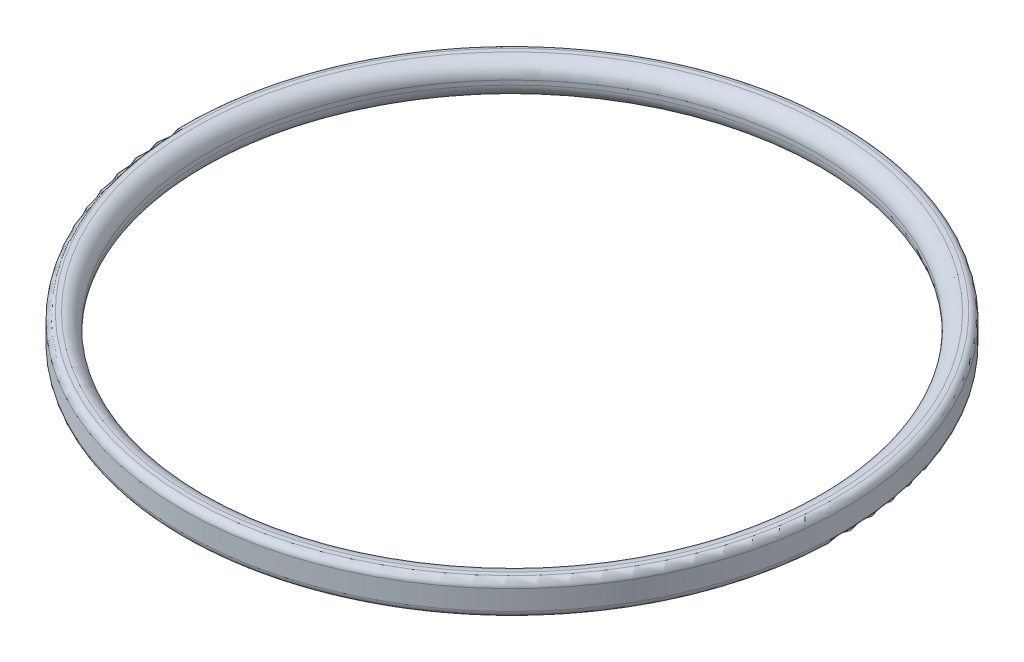
ISO-10303-21;
HEADER;
FILE_DESCRIPTION(('STEP AP214'),'2;1');
FILE_NAME('part.step','',(''),(''),'','','');
FILE_SCHEMA(('AUTOMOTIVE_DESIGN { 1 0 10303 214 1 1 1 1 }'));
ENDSEC;
DATA;
#1=APPLICATION_CONTEXT('core data for automotive mechanical design processes');
#2=APPLICATION_PROTOCOL_DEFINITION('international standard','automotive_design',2000,#1);
#3=PRODUCT_CONTEXT('',#1,'mechanical');
#4=PRODUCT('Part','Part','',(#3));
#5=PRODUCT_RELATED_PRODUCT_CATEGORY('part','',(#4));
#6=PRODUCT_DEFINITION_FORMATION('','',#4);
#7=PRODUCT_DEFINITION_CONTEXT('part definition',#1,'design');
#8=PRODUCT_DEFINITION('design','',#6,#7);
#9=PRODUCT_DEFINITION_SHAPE('','',#8);
#10=(LENGTH_UNIT() NAMED_UNIT(*) SI_UNIT(.MILLI.,.METRE.));
#11=(NAMED_UNIT(*) PLANE_ANGLE_UNIT() SI_UNIT($,.RADIAN.));
#12=(NAMED_UNIT(*) SI_UNIT($,.STERADIAN.) SOLID_ANGLE_UNIT());
#13=UNCERTAINTY_MEASURE_WITH_UNIT(LENGTH_MEASURE(1.E-05),#10,'distance_accuracy_value','');
#14=(GEOMETRIC_REPRESENTATION_CONTEXT(3) GLOBAL_UNCERTAINTY_ASSIGNED_CONTEXT((#13)) GLOBAL_UNIT_ASSIGNED_CONTEXT((#10,
#11,#12)) REPRESENTATION_CONTEXT('',''));
#15=CARTESIAN_POINT('',(0.,0.,0.));
#16=DIRECTION('',(0.,0.,1.));
#17=DIRECTION('',(1.,0.,0.));
#18=AXIS2_PLACEMENT_3D('',#15,#16,#17);
#19=CARTESIAN_POINT('',(0.,-55.,0.));
#20=DIRECTION('',(0.,-1.,0.));
#21=DIRECTION('',(0.,0.,-1.));
#22=AXIS2_PLACEMENT_3D('',#19,#20,#21);
#23=CYLINDRICAL_SURFACE('',#22,38.1);
#24=CARTESIAN_POINT('',(0.,0.761999999999999,0.));
#25=DIRECTION('',(0.,-1.,0.));
#26=DIRECTION('',(0.,0.,-1.));
#27=AXIS2_PLACEMENT_3D('',#24,#25,#26);
#28=CIRCLE('',#27,38.1);
#29=CARTESIAN_POINT('',(0.,0.761999999999999,-38.1));
#30=VERTEX_POINT('',#29);
#31=EDGE_CURVE('E39',#30,#30,#28,.F.);
#32=ORIENTED_EDGE('',*,*,#31,.T.);
#33=EDGE_LOOP('',(#32));
#34=FACE_BOUND('',#33,.T.);
#35=CARTESIAN_POINT('',(0.,3.048,0.));
#36=DIRECTION('',(0.,1.,0.));
#37=DIRECTION('',(0.,0.,1.));
#38=AXIS2_PLACEMENT_3D('',#35,#36,#37);
#39=CIRCLE('',#38,38.1);
#40=CARTESIAN_POINT('',(0.,3.048,38.1));
#41=VERTEX_POINT('',#40);
#42=EDGE_CURVE('E43',#41,#41,#39,.F.);
#43=ORIENTED_EDGE('',*,*,#42,.T.);
#44=EDGE_LOOP('',(#43));
#45=FACE_BOUND('',#44,.T.);
#46=ADVANCED_FACE('F32',(#34,#45),#23,.T.);
#47=CARTESIAN_POINT('',(38.1,0.,0.));
#48=DIRECTION('',(0.,-1.,0.));
#49=DIRECTION('',(0.,0.,-1.));
#50=AXIS2_PLACEMENT_3D('',#47,#48,#49);
#51=PLANE('',#50);
#52=CARTESIAN_POINT('',(0.,0.,0.));
#53=DIRECTION('',(0.,-1.,0.));
#54=DIRECTION('',(0.,0.,-1.));
#55=AXIS2_PLACEMENT_3D('',#52,#53,#54);
#56=CIRCLE('',#55,37.338);
#57=CARTESIAN_POINT('',(0.,0.,-37.338));
#58=VERTEX_POINT('',#57);
#59=EDGE_CURVE('E47',#58,#58,#56,.T.);
#60=ORIENTED_EDGE('',*,*,#59,.T.);
#61=EDGE_LOOP('',(#60));
#62=FACE_BOUND('',#61,.T.);
#63=CARTESIAN_POINT('',(0.,0.,0.));
#64=DIRECTION('',(0.,-1.,0.));
#65=DIRECTION('',(0.,0.,-1.));
#66=AXIS2_PLACEMENT_3D('',#63,#64,#65);
#67=CIRCLE('',#66,36.83);
#68=CARTESIAN_POINT('',(0.,0.,-36.83));
#69=VERTEX_POINT('',#68);
#70=EDGE_CURVE('E55',#69,#69,#67,.F.);
#71=ORIENTED_EDGE('',*,*,#70,.T.);
#72=EDGE_LOOP('',(#71));
#73=FACE_BOUND('',#72,.T.);
#74=ADVANCED_FACE('F84',(#62,#73),#51,.T.);
#75=CARTESIAN_POINT('',(0.,-55.,0.));
#76=DIRECTION('',(0.,-1.,0.));
#77=DIRECTION('',(0.,0.,-1.));
#78=AXIS2_PLACEMENT_3D('',#75,#76,#77);
#79=CYLINDRICAL_SURFACE('',#78,35.179);
#80=CARTESIAN_POINT('',(0.,1.651,0.));
#81=DIRECTION('',(0.,-1.,0.));
#82=DIRECTION('',(0.,0.,-1.));
#83=AXIS2_PLACEMENT_3D('',#80,#81,#82);
#84=CIRCLE('',#83,35.179);
#85=CARTESIAN_POINT('',(0.,1.651,-35.179));
#86=VERTEX_POINT('',#85);
#87=EDGE_CURVE('E58',#86,#86,#84,.T.);
#88=ORIENTED_EDGE('',*,*,#87,.T.);
#89=EDGE_LOOP('',(#88));
#90=FACE_BOUND('',#89,.T.);
#91=CARTESIAN_POINT('',(0.,2.159,0.));
#92=DIRECTION('',(0.,1.,0.));
#93=DIRECTION('',(0.,0.,1.));
#94=AXIS2_PLACEMENT_3D('',#91,#92,#93);
#95=CIRCLE('',#94,35.179);
#96=CARTESIAN_POINT('',(0.,2.159,35.179));
#97=VERTEX_POINT('',#96);
#98=EDGE_CURVE('E61',#97,#97,#95,.T.);
#99=ORIENTED_EDGE('',*,*,#98,.T.);
#100=EDGE_LOOP('',(#99));
#101=FACE_BOUND('',#100,.T.);
#102=ADVANCED_FACE('F65',(#90,#101),#79,.F.);
#103=CARTESIAN_POINT('',(35.179,3.81,0.));
#104=DIRECTION('',(0.,1.,0.));
#105=DIRECTION('',(0.,0.,1.));
#106=AXIS2_PLACEMENT_3D('',#103,#104,#105);
#107=PLANE('',#106);
#108=CARTESIAN_POINT('',(0.,3.81,0.));
#109=DIRECTION('',(0.,1.,0.));
#110=DIRECTION('',(0.,0.,1.));
#111=AXIS2_PLACEMENT_3D('',#108,#109,#110);
#112=CIRCLE('',#111,37.338);
#113=CARTESIAN_POINT('',(0.,3.81,37.338));
#114=VERTEX_POINT('',#113);
#115=EDGE_CURVE('E10',#114,#114,#112,.T.);
#116=ORIENTED_EDGE('',*,*,#115,.T.);
#117=EDGE_LOOP('',(#116));
#118=FACE_BOUND('',#117,.T.);
#119=CARTESIAN_POINT('',(0.,3.81,0.));
#120=DIRECTION('',(0.,1.,0.));
#121=DIRECTION('',(0.,0.,1.));
#122=AXIS2_PLACEMENT_3D('',#119,#120,#121);
#123=CIRCLE('',#122,36.83);
#124=CARTESIAN_POINT('',(0.,3.81,36.83));
#125=VERTEX_POINT('',#124);
#126=EDGE_CURVE('E52',#125,#125,#123,.F.);
#127=ORIENTED_EDGE('',*,*,#126,.T.);
#128=EDGE_LOOP('',(#127));
#129=FACE_BOUND('',#128,.T.);
#130=ADVANCED_FACE('F75',(#118,#129),#107,.T.);
#131=CARTESIAN_POINT('',(0.,1.651,0.));
#132=DIRECTION('',(0.,-1.,0.));
#133=DIRECTION('',(0.,0.,-1.));
#134=AXIS2_PLACEMENT_3D('',#131,#132,#133);
#135=TOROIDAL_SURFACE('',#134,36.83,1.651);
#136=ORIENTED_EDGE('',*,*,#70,.F.);
#137=EDGE_LOOP('',(#136));
#138=FACE_BOUND('',#137,.T.);
#139=ORIENTED_EDGE('',*,*,#87,.F.);
#140=EDGE_LOOP('',(#139));
#141=FACE_BOUND('',#140,.T.);
#142=ADVANCED_FACE('F71',(#138,#141),#135,.T.);
#143=CARTESIAN_POINT('',(0.,2.159,0.));
#144=DIRECTION('',(0.,1.,0.));
#145=DIRECTION('',(0.,0.,1.));
#146=AXIS2_PLACEMENT_3D('',#143,#144,#145);
#147=TOROIDAL_SURFACE('',#146,36.83,1.651);
#148=ORIENTED_EDGE('',*,*,#98,.F.);
#149=EDGE_LOOP('',(#148));
#150=FACE_BOUND('',#149,.T.);
#151=ORIENTED_EDGE('',*,*,#126,.F.);
#152=EDGE_LOOP('',(#151));
#153=FACE_BOUND('',#152,.T.);
#154=ADVANCED_FACE('F67',(#150,#153),#147,.T.);
#155=CARTESIAN_POINT('',(0.,0.761999999999999,0.));
#156=DIRECTION('',(0.,-1.,0.));
#157=DIRECTION('',(0.,0.,-1.));
#158=AXIS2_PLACEMENT_3D('',#155,#156,#157);
#159=TOROIDAL_SURFACE('',#158,37.338,0.762);
#160=ORIENTED_EDGE('',*,*,#31,.F.);
#161=EDGE_LOOP('',(#160));
#162=FACE_BOUND('',#161,.T.);
#163=ORIENTED_EDGE('',*,*,#59,.F.);
#164=EDGE_LOOP('',(#163));
#165=FACE_BOUND('',#164,.T.);
#166=ADVANCED_FACE('F70',(#162,#165),#159,.T.);
#167=CARTESIAN_POINT('',(0.,3.048,0.));
#168=DIRECTION('',(0.,1.,0.));
#169=DIRECTION('',(0.,0.,1.));
#170=AXIS2_PLACEMENT_3D('',#167,#168,#169);
#171=TOROIDAL_SURFACE('',#170,37.338,0.762);
#172=ORIENTED_EDGE('',*,*,#115,.F.);
#173=EDGE_LOOP('',(#172));
#174=FACE_BOUND('',#173,.T.);
#175=ORIENTED_EDGE('',*,*,#42,.F.);
#176=EDGE_LOOP('',(#175));
#177=FACE_BOUND('',#176,.T.);
#178=ADVANCED_FACE('F34',(#174,#177),#171,.T.);
#179=CLOSED_SHELL('',(#46,#74,#102,#130,#142,#154,#166,#178));
#180=MANIFOLD_SOLID_BREP('B2',#179);
#181=ADVANCED_BREP_SHAPE_REPRESENTATION('',(#18,#180),#14);
#182=SHAPE_DEFINITION_REPRESENTATION(#9,#181);
ENDSEC;
END-ISO-10303-21;
